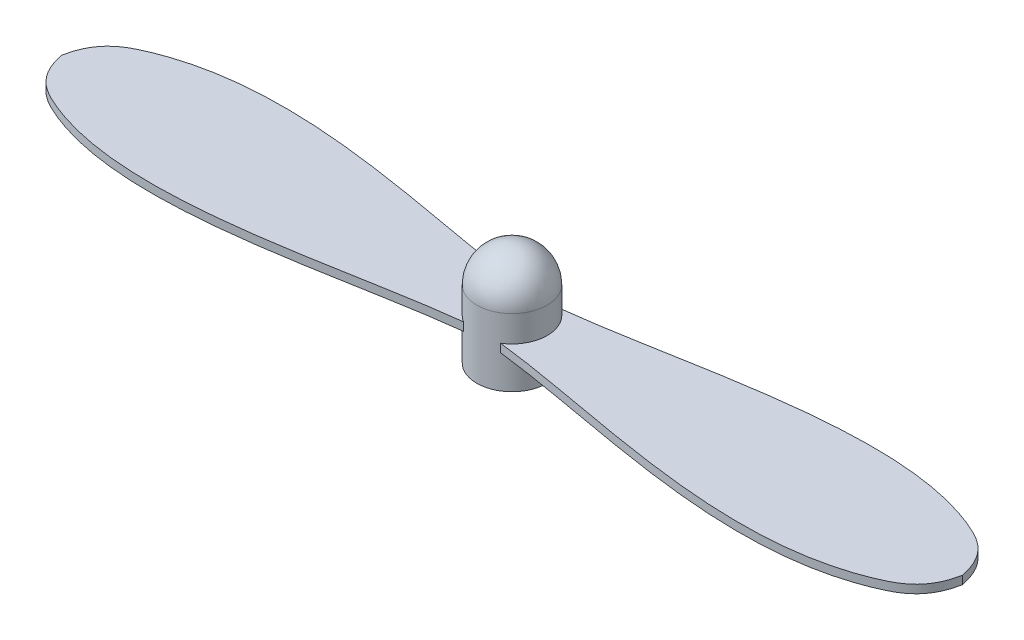
ISO-10303-21;
HEADER;
FILE_DESCRIPTION(('STEP AP214'),'2;1');
FILE_NAME('part.step','',(''),(''),'','','');
FILE_SCHEMA(('AUTOMOTIVE_DESIGN { 1 0 10303 214 1 1 1 1 }'));
ENDSEC;
DATA;
#1=APPLICATION_CONTEXT('core data for automotive mechanical design processes');
#2=APPLICATION_PROTOCOL_DEFINITION('international standard','automotive_design',2000,#1);
#3=PRODUCT_CONTEXT('',#1,'mechanical');
#4=PRODUCT('Part','Part','',(#3));
#5=PRODUCT_RELATED_PRODUCT_CATEGORY('part','',(#4));
#6=PRODUCT_DEFINITION_FORMATION('','',#4);
#7=PRODUCT_DEFINITION_CONTEXT('part definition',#1,'design');
#8=PRODUCT_DEFINITION('design','',#6,#7);
#9=PRODUCT_DEFINITION_SHAPE('','',#8);
#10=(LENGTH_UNIT() NAMED_UNIT(*) SI_UNIT(.MILLI.,.METRE.));
#11=(NAMED_UNIT(*) PLANE_ANGLE_UNIT() SI_UNIT($,.RADIAN.));
#12=(NAMED_UNIT(*) SI_UNIT($,.STERADIAN.) SOLID_ANGLE_UNIT());
#13=UNCERTAINTY_MEASURE_WITH_UNIT(LENGTH_MEASURE(1.E-05),#10,'distance_accuracy_value','');
#14=(GEOMETRIC_REPRESENTATION_CONTEXT(3) GLOBAL_UNCERTAINTY_ASSIGNED_CONTEXT((#13)) GLOBAL_UNIT_ASSIGNED_CONTEXT((#10,
#11,#12)) REPRESENTATION_CONTEXT('',''));
#15=CARTESIAN_POINT('',(0.,0.,0.));
#16=DIRECTION('',(0.,0.,1.));
#17=DIRECTION('',(1.,0.,0.));
#18=AXIS2_PLACEMENT_3D('',#15,#16,#17);
#19=CARTESIAN_POINT('',(0.,6.22,0.));
#20=DIRECTION('',(0.,-1.,0.));
#21=DIRECTION('',(0.,0.,-1.));
#22=AXIS2_PLACEMENT_3D('',#19,#20,#21);
#23=CYLINDRICAL_SURFACE('',#22,2.13);
#24=CARTESIAN_POINT('',(0.,2.5,0.));
#25=DIRECTION('',(0.,-1.,0.));
#26=DIRECTION('',(0.,0.,-1.));
#27=AXIS2_PLACEMENT_3D('',#24,#25,#26);
#28=CIRCLE('',#27,2.13);
#29=CARTESIAN_POINT('',(-1.12171189405821,2.5,1.81070771432839));
#30=VERTEX_POINT('',#29);
#31=CARTESIAN_POINT('',(-1.12171189405821,2.5,-1.81070771432839));
#32=VERTEX_POINT('',#31);
#33=EDGE_CURVE('E148',#30,#32,#28,.T.);
#34=ORIENTED_EDGE('',*,*,#33,.F.);
#35=DIRECTION('',(0.,-1.,0.));
#36=VECTOR('',#35,1.);
#37=CARTESIAN_POINT('',(-1.12171189405821,2.5,1.81070771432839));
#38=LINE('',#37,#36);
#39=CARTESIAN_POINT('',(-1.12171189405821,2.,1.81070771432839));
#40=VERTEX_POINT('',#39);
#41=EDGE_CURVE('E175',#30,#40,#38,.T.);
#42=ORIENTED_EDGE('',*,*,#41,.T.);
#43=CARTESIAN_POINT('',(0.,2.,0.));
#44=DIRECTION('',(0.,-1.,0.));
#45=DIRECTION('',(0.,0.,-1.));
#46=AXIS2_PLACEMENT_3D('',#43,#44,#45);
#47=CIRCLE('',#46,2.13);
#48=CARTESIAN_POINT('',(-1.12171189405821,2.,-1.81070771432839));
#49=VERTEX_POINT('',#48);
#50=EDGE_CURVE('E169',#40,#49,#47,.T.);
#51=ORIENTED_EDGE('',*,*,#50,.T.);
#52=DIRECTION('',(0.,-1.,0.));
#53=VECTOR('',#52,1.);
#54=CARTESIAN_POINT('',(-1.12171189405821,2.5,-1.81070771432839));
#55=LINE('',#54,#53);
#56=EDGE_CURVE('E179',#32,#49,#55,.T.);
#57=ORIENTED_EDGE('',*,*,#56,.F.);
#58=EDGE_LOOP('',(#34,#42,#51,#57));
#59=FACE_BOUND('',#58,.T.);
#60=CARTESIAN_POINT('',(0.,4.09,0.));
#61=DIRECTION('',(0.,-1.,0.));
#62=DIRECTION('',(0.,0.,-1.));
#63=AXIS2_PLACEMENT_3D('',#60,#61,#62);
#64=CIRCLE('',#63,2.13);
#65=CARTESIAN_POINT('',(0.,4.09,-2.13));
#66=VERTEX_POINT('',#65);
#67=EDGE_CURVE('E11',#66,#66,#64,.T.);
#68=ORIENTED_EDGE('',*,*,#67,.T.);
#69=EDGE_LOOP('',(#68));
#70=FACE_BOUND('',#69,.T.);
#71=CARTESIAN_POINT('',(0.,0.,0.));
#72=DIRECTION('',(0.,1.,0.));
#73=DIRECTION('',(0.,0.,1.));
#74=AXIS2_PLACEMENT_3D('',#71,#72,#73);
#75=CIRCLE('',#74,2.13);
#76=CARTESIAN_POINT('',(0.,0.,2.13));
#77=VERTEX_POINT('',#76);
#78=EDGE_CURVE('E40',#77,#77,#75,.T.);
#79=ORIENTED_EDGE('',*,*,#78,.T.);
#80=EDGE_LOOP('',(#79));
#81=FACE_BOUND('',#80,.T.);
#82=CARTESIAN_POINT('',(0.,2.5,0.));
#83=DIRECTION('',(0.,-1.,0.));
#84=DIRECTION('',(0.,0.,-1.));
#85=AXIS2_PLACEMENT_3D('',#82,#83,#84);
#86=CIRCLE('',#85,2.13);
#87=CARTESIAN_POINT('',(1.12171189405821,2.5,-1.81070771432839));
#88=VERTEX_POINT('',#87);
#89=CARTESIAN_POINT('',(1.12171189405821,2.5,1.81070771432839));
#90=VERTEX_POINT('',#89);
#91=EDGE_CURVE('E95',#88,#90,#86,.T.);
#92=ORIENTED_EDGE('',*,*,#91,.F.);
#93=DIRECTION('',(0.,-1.,0.));
#94=VECTOR('',#93,1.);
#95=CARTESIAN_POINT('',(1.12171189405821,2.5,-1.81070771432839));
#96=LINE('',#95,#94);
#97=CARTESIAN_POINT('',(1.12171189405821,2.,-1.81070771432839));
#98=VERTEX_POINT('',#97);
#99=EDGE_CURVE('E101',#88,#98,#96,.T.);
#100=ORIENTED_EDGE('',*,*,#99,.T.);
#101=CARTESIAN_POINT('',(0.,2.,0.));
#102=DIRECTION('',(0.,-1.,0.));
#103=DIRECTION('',(0.,0.,-1.));
#104=AXIS2_PLACEMENT_3D('',#101,#102,#103);
#105=CIRCLE('',#104,2.13);
#106=CARTESIAN_POINT('',(1.12171189405821,2.,1.81070771432839));
#107=VERTEX_POINT('',#106);
#108=EDGE_CURVE('E104',#98,#107,#105,.T.);
#109=ORIENTED_EDGE('',*,*,#108,.T.);
#110=DIRECTION('',(0.,-1.,0.));
#111=VECTOR('',#110,1.);
#112=CARTESIAN_POINT('',(1.12171189405821,2.5,1.81070771432839));
#113=LINE('',#112,#111);
#114=EDGE_CURVE('E94',#90,#107,#113,.T.);
#115=ORIENTED_EDGE('',*,*,#114,.F.);
#116=EDGE_LOOP('',(#92,#100,#109,#115));
#117=FACE_BOUND('',#116,.T.);
#118=ADVANCED_FACE('F32',(#59,#70,#81,#117),#23,.T.);
#119=CARTESIAN_POINT('',(0.,0.,0.));
#120=DIRECTION('',(0.,1.,0.));
#121=DIRECTION('',(0.,0.,1.));
#122=AXIS2_PLACEMENT_3D('',#119,#120,#121);
#123=PLANE('',#122);
#124=CARTESIAN_POINT('',(0.,0.,0.));
#125=DIRECTION('',(0.,-1.,0.));
#126=DIRECTION('',(0.,0.,-1.));
#127=AXIS2_PLACEMENT_3D('',#124,#125,#126);
#128=CIRCLE('',#127,0.5);
#129=CARTESIAN_POINT('',(0.,0.,-0.5));
#130=VERTEX_POINT('',#129);
#131=EDGE_CURVE('E178',#130,#130,#128,.T.);
#132=ORIENTED_EDGE('',*,*,#131,.F.);
#133=EDGE_LOOP('',(#132));
#134=FACE_BOUND('',#133,.T.);
#135=ORIENTED_EDGE('',*,*,#78,.F.);
#136=EDGE_LOOP('',(#135));
#137=FACE_BOUND('',#136,.T.);
#138=ADVANCED_FACE('F191',(#134,#137),#123,.F.);
#139=CARTESIAN_POINT('',(0.,5.,0.));
#140=DIRECTION('',(0.,-1.,0.));
#141=DIRECTION('',(0.,0.,-1.));
#142=AXIS2_PLACEMENT_3D('',#139,#140,#141);
#143=CYLINDRICAL_SURFACE('',#142,0.5);
#144=CARTESIAN_POINT('',(0.,5.,0.));
#145=DIRECTION('',(0.,-1.,0.));
#146=DIRECTION('',(0.,0.,-1.));
#147=AXIS2_PLACEMENT_3D('',#144,#145,#146);
#148=CIRCLE('',#147,0.5);
#149=CARTESIAN_POINT('',(0.,5.,-0.5));
#150=VERTEX_POINT('',#149);
#151=EDGE_CURVE('E182',#150,#150,#148,.T.);
#152=ORIENTED_EDGE('',*,*,#151,.F.);
#153=EDGE_LOOP('',(#152));
#154=FACE_BOUND('',#153,.T.);
#155=ORIENTED_EDGE('',*,*,#131,.T.);
#156=EDGE_LOOP('',(#155));
#157=FACE_BOUND('',#156,.T.);
#158=ADVANCED_FACE('F193',(#154,#157),#143,.F.);
#159=CARTESIAN_POINT('',(0.,5.,0.));
#160=DIRECTION('',(0.,-1.,0.));
#161=DIRECTION('',(0.,0.,-1.));
#162=AXIS2_PLACEMENT_3D('',#159,#160,#161);
#163=PLANE('',#162);
#164=ORIENTED_EDGE('',*,*,#151,.T.);
#165=EDGE_LOOP('',(#164));
#166=FACE_BOUND('',#165,.T.);
#167=ADVANCED_FACE('F200',(#166),#163,.T.);
#168=CARTESIAN_POINT('',(0.,4.09,0.));
#169=DIRECTION('',(0.,1.,0.));
#170=DIRECTION('',(0.,0.,1.));
#171=AXIS2_PLACEMENT_3D('',#168,#169,#170);
#172=SPHERICAL_SURFACE('',#171,2.13);
#173=ORIENTED_EDGE('',*,*,#67,.F.);
#174=EDGE_LOOP('',(#173));
#175=FACE_BOUND('',#174,.T.);
#176=ADVANCED_FACE('F34',(#175),#172,.T.);
#177=CARTESIAN_POINT('',(-27.225,2.5,0.));
#178=CARTESIAN_POINT('',(-26.8837199263888,2.5,1.70758804462991));
#179=CARTESIAN_POINT('',(-19.5902178685423,2.5,6.21812063016258));
#180=CARTESIAN_POINT('',(-7.79108971988479,2.5,2.56467098650401));
#181=CARTESIAN_POINT('',(-1.12171189405822,2.5,1.8107077143284));
#182=B_SPLINE_CURVE_WITH_KNOTS('',3,(#177,#178,#179,#180,#181),.UNSPECIFIED.,.F.,.F.,(4,1,4),
(0.,0.130362346141907,1.),.UNSPECIFIED.);
#183=DIRECTION('',(0.,-1.,0.));
#184=VECTOR('',#183,1.);
#185=SURFACE_OF_LINEAR_EXTRUSION('',#182,#184);
#186=CARTESIAN_POINT('',(-27.225,2.,0.));
#187=CARTESIAN_POINT('',(-26.8837199263888,2.,1.70758804462991));
#188=CARTESIAN_POINT('',(-19.5902178685423,2.,6.21812063016258));
#189=CARTESIAN_POINT('',(-7.79108971988479,2.,2.56467098650401));
#190=CARTESIAN_POINT('',(-1.12171189405822,2.,1.8107077143284));
#191=B_SPLINE_CURVE_WITH_KNOTS('',3,(#186,#187,#188,#189,#190),.UNSPECIFIED.,.F.,.F.,(4,1,4),
(0.,0.130362346141907,1.),.UNSPECIFIED.);
#192=CARTESIAN_POINT('',(-27.225,2.,0.));
#193=VERTEX_POINT('',#192);
#194=EDGE_CURVE('E158',#193,#40,#191,.T.);
#195=ORIENTED_EDGE('',*,*,#194,.T.);
#196=ORIENTED_EDGE('',*,*,#41,.F.);
#197=CARTESIAN_POINT('',(-27.225,2.5,0.));
#198=VERTEX_POINT('',#197);
#199=EDGE_CURVE('E149',#198,#30,#182,.T.);
#200=ORIENTED_EDGE('',*,*,#199,.F.);
#201=DIRECTION('',(0.,-1.,0.));
#202=VECTOR('',#201,1.);
#203=CARTESIAN_POINT('',(-27.225,2.5,0.));
#204=LINE('',#203,#202);
#205=EDGE_CURVE('E157',#198,#193,#204,.T.);
#206=ORIENTED_EDGE('',*,*,#205,.T.);
#207=EDGE_LOOP('',(#195,#196,#200,#206));
#208=FACE_BOUND('',#207,.T.);
#209=ADVANCED_FACE('F138',(#208),#185,.F.);
#210=CARTESIAN_POINT('',(-27.225,2.5,0.));
#211=CARTESIAN_POINT('',(-26.8837199263888,2.5,-1.70758804462991));
#212=CARTESIAN_POINT('',(-19.5902178685423,2.5,-6.21812063016257));
#213=CARTESIAN_POINT('',(-7.79108971988479,2.5,-2.56467098650401));
#214=CARTESIAN_POINT('',(-1.12171189405822,2.5,-1.81070771432839));
#215=B_SPLINE_CURVE_WITH_KNOTS('',3,(#210,#211,#212,#213,#214),.UNSPECIFIED.,.F.,.F.,(4,1,4),
(0.,0.130362346141907,1.),.UNSPECIFIED.);
#216=DIRECTION('',(0.,-1.,0.));
#217=VECTOR('',#216,1.);
#218=SURFACE_OF_LINEAR_EXTRUSION('',#215,#217);
#219=CARTESIAN_POINT('',(-27.225,2.,0.));
#220=CARTESIAN_POINT('',(-26.8837199263888,2.,-1.70758804462991));
#221=CARTESIAN_POINT('',(-19.5902178685423,2.,-6.21812063016257));
#222=CARTESIAN_POINT('',(-7.79108971988479,2.,-2.56467098650401));
#223=CARTESIAN_POINT('',(-1.12171189405822,2.,-1.81070771432839));
#224=B_SPLINE_CURVE_WITH_KNOTS('',3,(#219,#220,#221,#222,#223),.UNSPECIFIED.,.F.,.F.,(4,1,4),
(0.,0.130362346141907,1.),.UNSPECIFIED.);
#225=EDGE_CURVE('E55',#193,#49,#224,.T.);
#226=ORIENTED_EDGE('',*,*,#225,.F.);
#227=ORIENTED_EDGE('',*,*,#205,.F.);
#228=EDGE_CURVE('E142',#198,#32,#215,.T.);
#229=ORIENTED_EDGE('',*,*,#228,.T.);
#230=ORIENTED_EDGE('',*,*,#56,.T.);
#231=EDGE_LOOP('',(#226,#227,#229,#230));
#232=FACE_BOUND('',#231,.T.);
#233=ADVANCED_FACE('F131',(#232),#218,.T.);
#234=CARTESIAN_POINT('',(0.,2.5,0.));
#235=DIRECTION('',(0.,-1.,0.));
#236=DIRECTION('',(0.,0.,-1.));
#237=AXIS2_PLACEMENT_3D('',#234,#235,#236);
#238=PLANE('',#237);
#239=ORIENTED_EDGE('',*,*,#199,.T.);
#240=ORIENTED_EDGE('',*,*,#33,.T.);
#241=ORIENTED_EDGE('',*,*,#228,.F.);
#242=EDGE_LOOP('',(#239,#240,#241));
#243=FACE_BOUND('',#242,.T.);
#244=ADVANCED_FACE('F128',(#243),#238,.F.);
#245=CARTESIAN_POINT('',(0.,2.,0.));
#246=DIRECTION('',(0.,-1.,0.));
#247=DIRECTION('',(0.,0.,-1.));
#248=AXIS2_PLACEMENT_3D('',#245,#246,#247);
#249=PLANE('',#248);
#250=ORIENTED_EDGE('',*,*,#194,.F.);
#251=ORIENTED_EDGE('',*,*,#225,.T.);
#252=ORIENTED_EDGE('',*,*,#50,.F.);
#253=EDGE_LOOP('',(#250,#251,#252));
#254=FACE_BOUND('',#253,.T.);
#255=ADVANCED_FACE('F127',(#254),#249,.T.);
#256=CARTESIAN_POINT('',(27.225,2.5,0.));
#257=CARTESIAN_POINT('',(26.8837199263888,2.5,-1.7075880446299));
#258=CARTESIAN_POINT('',(19.5902178685423,2.5,-6.21812063016257));
#259=CARTESIAN_POINT('',(7.79108971988479,2.5,-2.564670986504));
#260=CARTESIAN_POINT('',(1.12171189405821,2.5,-1.81070771432839));
#261=B_SPLINE_CURVE_WITH_KNOTS('',3,(#256,#257,#258,#259,#260),.UNSPECIFIED.,.F.,.F.,(4,1,4),
(0.,0.130362346141907,1.),.UNSPECIFIED.);
#262=DIRECTION('',(0.,-1.,0.));
#263=VECTOR('',#262,1.);
#264=SURFACE_OF_LINEAR_EXTRUSION('',#261,#263);
#265=CARTESIAN_POINT('',(27.225,2.,0.));
#266=CARTESIAN_POINT('',(26.8837199263888,2.,-1.7075880446299));
#267=CARTESIAN_POINT('',(19.5902178685423,2.,-6.21812063016257));
#268=CARTESIAN_POINT('',(7.79108971988479,2.,-2.564670986504));
#269=CARTESIAN_POINT('',(1.12171189405821,2.,-1.81070771432839));
#270=B_SPLINE_CURVE_WITH_KNOTS('',3,(#265,#266,#267,#268,#269),.UNSPECIFIED.,.F.,.F.,(4,1,4),
(0.,0.130362346141907,1.),.UNSPECIFIED.);
#271=CARTESIAN_POINT('',(27.225,2.,0.));
#272=VERTEX_POINT('',#271);
#273=EDGE_CURVE('E298',#272,#98,#270,.T.);
#274=ORIENTED_EDGE('',*,*,#273,.T.);
#275=ORIENTED_EDGE('',*,*,#99,.F.);
#276=CARTESIAN_POINT('',(27.225,2.5,0.));
#277=VERTEX_POINT('',#276);
#278=EDGE_CURVE('E98',#277,#88,#261,.T.);
#279=ORIENTED_EDGE('',*,*,#278,.F.);
#280=DIRECTION('',(0.,-1.,0.));
#281=VECTOR('',#280,1.);
#282=CARTESIAN_POINT('',(27.225,2.5,0.));
#283=LINE('',#282,#281);
#284=EDGE_CURVE('E86',#277,#272,#283,.T.);
#285=ORIENTED_EDGE('',*,*,#284,.T.);
#286=EDGE_LOOP('',(#274,#275,#279,#285));
#287=FACE_BOUND('',#286,.T.);
#288=ADVANCED_FACE('F99',(#287),#264,.F.);
#289=CARTESIAN_POINT('',(27.225,2.5,0.));
#290=CARTESIAN_POINT('',(26.8837199263888,2.5,1.70758804462992));
#291=CARTESIAN_POINT('',(19.5902178685423,2.5,6.21812063016258));
#292=CARTESIAN_POINT('',(7.79108971988479,2.5,2.56467098650401));
#293=CARTESIAN_POINT('',(1.12171189405821,2.5,1.8107077143284));
#294=B_SPLINE_CURVE_WITH_KNOTS('',3,(#289,#290,#291,#292,#293),.UNSPECIFIED.,.F.,.F.,(4,1,4),
(0.,0.130362346141907,1.),.UNSPECIFIED.);
#295=DIRECTION('',(0.,-1.,0.));
#296=VECTOR('',#295,1.);
#297=SURFACE_OF_LINEAR_EXTRUSION('',#294,#296);
#298=CARTESIAN_POINT('',(27.225,2.,0.));
#299=CARTESIAN_POINT('',(26.8837199263888,2.,1.70758804462992));
#300=CARTESIAN_POINT('',(19.5902178685423,2.,6.21812063016258));
#301=CARTESIAN_POINT('',(7.79108971988479,2.,2.56467098650401));
#302=CARTESIAN_POINT('',(1.12171189405821,2.,1.8107077143284));
#303=B_SPLINE_CURVE_WITH_KNOTS('',3,(#298,#299,#300,#301,#302),.UNSPECIFIED.,.F.,.F.,(4,1,4),
(0.,0.130362346141907,1.),.UNSPECIFIED.);
#304=EDGE_CURVE('E47',#272,#107,#303,.T.);
#305=ORIENTED_EDGE('',*,*,#304,.F.);
#306=ORIENTED_EDGE('',*,*,#284,.F.);
#307=EDGE_CURVE('E90',#277,#90,#294,.T.);
#308=ORIENTED_EDGE('',*,*,#307,.T.);
#309=ORIENTED_EDGE('',*,*,#114,.T.);
#310=EDGE_LOOP('',(#305,#306,#308,#309));
#311=FACE_BOUND('',#310,.T.);
#312=ADVANCED_FACE('F88',(#311),#297,.T.);
#313=CARTESIAN_POINT('',(0.,2.5,0.));
#314=DIRECTION('',(0.,-1.,0.));
#315=DIRECTION('',(0.,0.,-1.));
#316=AXIS2_PLACEMENT_3D('',#313,#314,#315);
#317=PLANE('',#316);
#318=ORIENTED_EDGE('',*,*,#278,.T.);
#319=ORIENTED_EDGE('',*,*,#91,.T.);
#320=ORIENTED_EDGE('',*,*,#307,.F.);
#321=EDGE_LOOP('',(#318,#319,#320));
#322=FACE_BOUND('',#321,.T.);
#323=ADVANCED_FACE('F106',(#322),#317,.F.);
#324=CARTESIAN_POINT('',(0.,2.,0.));
#325=DIRECTION('',(0.,-1.,0.));
#326=DIRECTION('',(0.,0.,-1.));
#327=AXIS2_PLACEMENT_3D('',#324,#325,#326);
#328=PLANE('',#327);
#329=ORIENTED_EDGE('',*,*,#273,.F.);
#330=ORIENTED_EDGE('',*,*,#304,.T.);
#331=ORIENTED_EDGE('',*,*,#108,.F.);
#332=EDGE_LOOP('',(#329,#330,#331));
#333=FACE_BOUND('',#332,.T.);
#334=ADVANCED_FACE('F123',(#333),#328,.T.);
#335=CLOSED_SHELL('',(#118,#138,#158,#167,#176,#209,#233,#244,#255,#288,#312,#323,#334));
#336=MANIFOLD_SOLID_BREP('B2',#335);
#337=ADVANCED_BREP_SHAPE_REPRESENTATION('',(#18,#336),#14);
#338=SHAPE_DEFINITION_REPRESENTATION(#9,#337);
ENDSEC;
END-ISO-10303-21;
